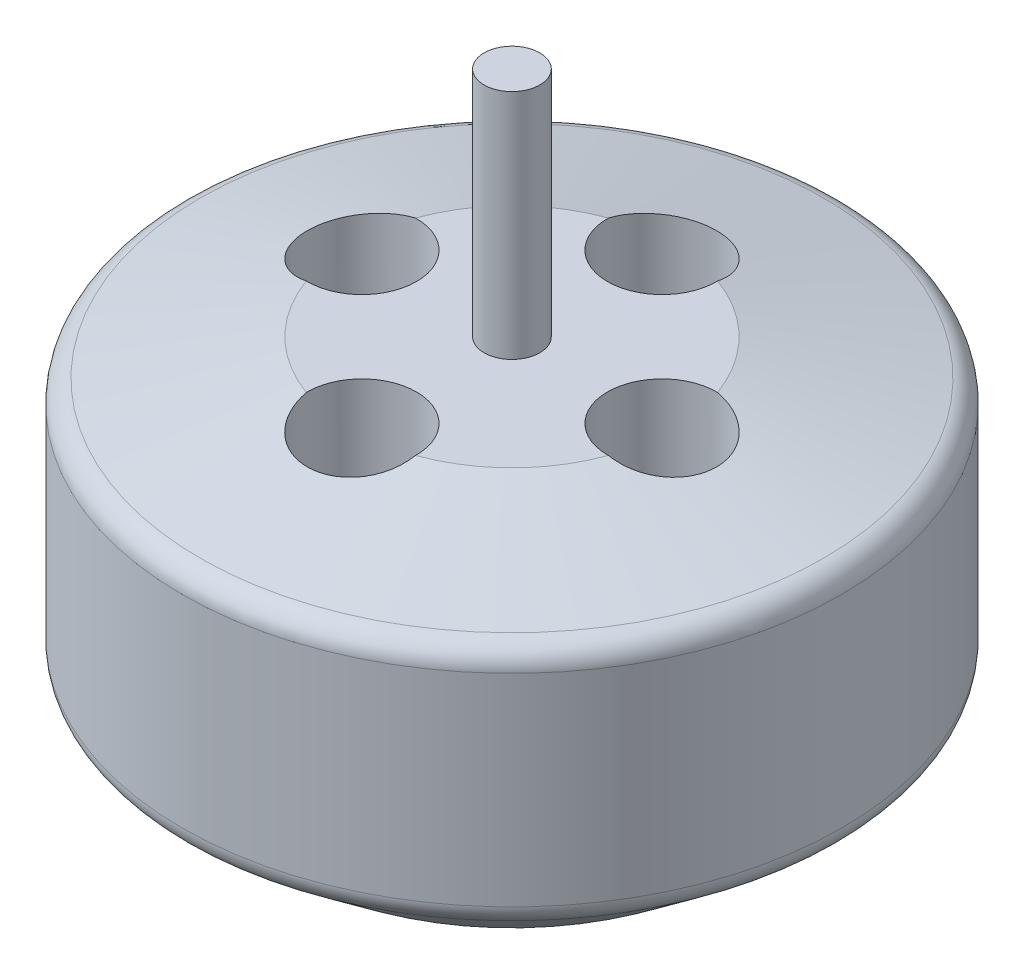
ISO-10303-21;
HEADER;
FILE_DESCRIPTION(('STEP AP214'),'2;1');
FILE_NAME('part.step','',(''),(''),'','','');
FILE_SCHEMA(('AUTOMOTIVE_DESIGN { 1 0 10303 214 1 1 1 1 }'));
ENDSEC;
DATA;
#1=APPLICATION_CONTEXT('core data for automotive mechanical design processes');
#2=APPLICATION_PROTOCOL_DEFINITION('international standard','automotive_design',2000,#1);
#3=PRODUCT_CONTEXT('',#1,'mechanical');
#4=PRODUCT('Part','Part','',(#3));
#5=PRODUCT_RELATED_PRODUCT_CATEGORY('part','',(#4));
#6=PRODUCT_DEFINITION_FORMATION('','',#4);
#7=PRODUCT_DEFINITION_CONTEXT('part definition',#1,'design');
#8=PRODUCT_DEFINITION('design','',#6,#7);
#9=PRODUCT_DEFINITION_SHAPE('','',#8);
#10=(LENGTH_UNIT() NAMED_UNIT(*) SI_UNIT(.MILLI.,.METRE.));
#11=(NAMED_UNIT(*) PLANE_ANGLE_UNIT() SI_UNIT($,.RADIAN.));
#12=(NAMED_UNIT(*) SI_UNIT($,.STERADIAN.) SOLID_ANGLE_UNIT());
#13=UNCERTAINTY_MEASURE_WITH_UNIT(LENGTH_MEASURE(1.E-05),#10,'distance_accuracy_value','');
#14=(GEOMETRIC_REPRESENTATION_CONTEXT(3) GLOBAL_UNCERTAINTY_ASSIGNED_CONTEXT((#13)) GLOBAL_UNIT_ASSIGNED_CONTEXT((#10,
#11,#12)) REPRESENTATION_CONTEXT('',''));
#15=CARTESIAN_POINT('',(0.,0.,0.));
#16=DIRECTION('',(0.,0.,1.));
#17=DIRECTION('',(1.,0.,0.));
#18=AXIS2_PLACEMENT_3D('',#15,#16,#17);
#19=CARTESIAN_POINT('',(1.2,9.23124075479543,0.));
#20=DIRECTION('',(0.,-1.,0.));
#21=DIRECTION('',(1.,0.,0.));
#22=AXIS2_PLACEMENT_3D('',#19,#20,#21);
#23=PLANE('',#22);
#24=CARTESIAN_POINT('',(0.,9.23124075479543,0.));
#25=DIRECTION('',(0.,1.,0.));
#26=DIRECTION('',(-1.,0.,0.));
#27=AXIS2_PLACEMENT_3D('',#24,#25,#26);
#28=CIRCLE('',#27,1.2);
#29=CARTESIAN_POINT('',(-1.2,9.23124075479543,0.));
#30=VERTEX_POINT('',#29);
#31=EDGE_CURVE('E340',#30,#30,#28,.T.);
#32=ORIENTED_EDGE('',*,*,#31,.T.);
#33=EDGE_LOOP('',(#32));
#34=FACE_BOUND('',#33,.T.);
#35=ADVANCED_FACE('F42',(#34),#23,.F.);
#36=CARTESIAN_POINT('',(0.,-15.7687592452046,0.));
#37=DIRECTION('',(0.,1.,0.));
#38=DIRECTION('',(-1.,0.,0.));
#39=AXIS2_PLACEMENT_3D('',#36,#37,#38);
#40=PLANE('',#39);
#41=CARTESIAN_POINT('',(0.,-15.7687592452046,0.));
#42=DIRECTION('',(0.,1.,0.));
#43=DIRECTION('',(-1.,0.,0.));
#44=AXIS2_PLACEMENT_3D('',#41,#42,#43);
#45=CIRCLE('',#44,10.);
#46=CARTESIAN_POINT('',(-10.,-15.7687592452046,0.));
#47=VERTEX_POINT('',#46);
#48=EDGE_CURVE('E106',#47,#47,#45,.T.);
#49=ORIENTED_EDGE('',*,*,#48,.F.);
#50=EDGE_LOOP('',(#49));
#51=FACE_BOUND('',#50,.T.);
#52=ADVANCED_FACE('F153',(#51),#40,.F.);
#53=CARTESIAN_POINT('',(0.,-15.7687592452046,0.));
#54=DIRECTION('',(0.,1.,0.));
#55=DIRECTION('',(-1.,0.,0.));
#56=AXIS2_PLACEMENT_3D('',#53,#54,#55);
#57=CONICAL_SURFACE('',#56,10.,0.91044247390561);
#58=CARTESIAN_POINT('',(0.,-12.79594785704,0.));
#59=DIRECTION('',(0.,-1.,0.));
#60=DIRECTION('',(1.,0.,0.));
#61=AXIS2_PLACEMENT_3D('',#58,#59,#60);
#62=CIRCLE('',#61,13.8276275638373);
#63=CARTESIAN_POINT('',(13.8276275638373,-12.79594785704,0.));
#64=VERTEX_POINT('',#63);
#65=EDGE_CURVE('E50',#64,#64,#62,.T.);
#66=ORIENTED_EDGE('',*,*,#65,.T.);
#67=EDGE_LOOP('',(#66));
#68=FACE_BOUND('',#67,.T.);
#69=ORIENTED_EDGE('',*,*,#48,.T.);
#70=EDGE_LOOP('',(#69));
#71=FACE_BOUND('',#70,.T.);
#72=ADVANCED_FACE('F124',(#68,#71),#57,.T.);
#73=CARTESIAN_POINT('',(0.,9.23124075479543,0.));
#74=DIRECTION('',(0.,1.,0.));
#75=DIRECTION('',(-1.,0.,0.));
#76=AXIS2_PLACEMENT_3D('',#73,#74,#75);
#77=CYLINDRICAL_SURFACE('',#76,14.2142312092208);
#78=CARTESIAN_POINT('',(0.,-12.0061726281659,0.));
#79=DIRECTION('',(0.,-1.,0.));
#80=DIRECTION('',(1.,0.,0.));
#81=AXIS2_PLACEMENT_3D('',#78,#79,#80);
#82=CIRCLE('',#81,14.2142312092208);
#83=CARTESIAN_POINT('',(14.2142312092208,-12.0061726281659,0.));
#84=VERTEX_POINT('',#83);
#85=EDGE_CURVE('E119',#84,#84,#82,.F.);
#86=ORIENTED_EDGE('',*,*,#85,.T.);
#87=EDGE_LOOP('',(#86));
#88=FACE_BOUND('',#87,.T.);
#89=CARTESIAN_POINT('',(0.,-3.28649118160691,0.));
#90=DIRECTION('',(0.,-1.,0.));
#91=DIRECTION('',(1.,0.,0.));
#92=AXIS2_PLACEMENT_3D('',#89,#90,#91);
#93=CIRCLE('',#92,14.2142312092208);
#94=CARTESIAN_POINT('',(14.2142312092208,-3.28649118160691,0.));
#95=VERTEX_POINT('',#94);
#96=EDGE_CURVE('E116',#95,#95,#93,.T.);
#97=ORIENTED_EDGE('',*,*,#96,.T.);
#98=EDGE_LOOP('',(#97));
#99=FACE_BOUND('',#98,.T.);
#100=ADVANCED_FACE('F133',(#88,#99),#77,.T.);
#101=CARTESIAN_POINT('',(0.,-2.4956836070486,0.));
#102=DIRECTION('',(0.,-1.,0.));
#103=DIRECTION('',(1.,0.,0.));
#104=AXIS2_PLACEMENT_3D('',#101,#102,#103);
#105=CONICAL_SURFACE('',#104,14.2142312092208,1.33822123398075);
#106=CARTESIAN_POINT('',(0.,-2.31341507747465,0.));
#107=DIRECTION('',(0.,1.,0.));
#108=DIRECTION('',(-1.,0.,0.));
#109=AXIS2_PLACEMENT_3D('',#106,#107,#108);
#110=CIRCLE('',#109,13.4447152554514);
#111=CARTESIAN_POINT('',(-13.4447152554514,-2.31341507747465,0.));
#112=VERTEX_POINT('',#111);
#113=EDGE_CURVE('E11',#112,#112,#110,.T.);
#114=ORIENTED_EDGE('',*,*,#113,.T.);
#115=EDGE_LOOP('',(#114));
#116=FACE_BOUND('',#115,.T.);
#117=CARTESIAN_POINT('',(0.,-0.768759245204573,0.));
#118=DIRECTION('',(0.,1.,0.));
#119=DIRECTION('',(-1.,0.,0.));
#120=AXIS2_PLACEMENT_3D('',#117,#118,#119);
#121=CIRCLE('',#120,6.92336289257609);
#122=CARTESIAN_POINT('',(6.51163456727097,-0.768759245204573,-2.35192878391788));
#123=VERTEX_POINT('',#122);
#124=CARTESIAN_POINT('',(2.35192878391786,-0.768759245204573,-6.51163456727098));
#125=VERTEX_POINT('',#124);
#126=EDGE_CURVE('E100',#123,#125,#121,.T.);
#127=ORIENTED_EDGE('',*,*,#126,.F.);
#128=CARTESIAN_POINT('',(6.51073113622683,-0.768559245204572,-2.35194444719157));
#129=CARTESIAN_POINT('',(6.57745570014125,-0.783332000693089,-2.35079951486765));
#130=CARTESIAN_POINT('',(6.64414594371814,-0.797896410721011,-2.34681484952383));
#131=CARTESIAN_POINT('',(6.77704791080668,-0.826556435951298,-2.33317538062952));
#132=CARTESIAN_POINT('',(6.84325961566661,-0.840652032957309,-2.32352035726236));
#133=CARTESIAN_POINT('',(7.04043922069012,-0.882131542247833,-2.28608604984196));
#134=CARTESIAN_POINT('',(7.17006979071747,-0.908734201870526,-2.24983548351801));
#135=CARTESIAN_POINT('',(7.42175242029025,-0.959348046210853,-2.15552952535404));
#136=CARTESIAN_POINT('',(7.54379764298048,-0.983356907059352,-2.09745478572058));
#137=CARTESIAN_POINT('',(7.77652527636077,-1.02836673670914,-1.96099362154545));
#138=CARTESIAN_POINT('',(7.88721277280557,-1.04936905345793,-1.88261634396145));
#139=CARTESIAN_POINT('',(8.09242117753741,-1.08777141214169,-1.70885134274292));
#140=CARTESIAN_POINT('',(8.1871395859977,-1.10521612446328,-1.61370670887939));
#141=CARTESIAN_POINT('',(8.35927102691237,-1.13658432289664,-1.40833474847909));
#142=CARTESIAN_POINT('',(8.43668214306363,-1.15050741910939,-1.29810575394336));
#143=CARTESIAN_POINT('',(8.57056019382037,-1.17440477346539,-1.06773986315712));
#144=CARTESIAN_POINT('',(8.62736161665646,-1.18444229161354,-0.947803860994472));
#145=CARTESIAN_POINT('',(8.72006108790814,-1.20074842149062,-0.699878812982907));
#146=CARTESIAN_POINT('',(8.75596226284117,-1.20701759693939,-0.571890974802866));
#147=CARTESIAN_POINT('',(8.80543268258466,-1.21564116706093,-0.313146809127175));
#148=CARTESIAN_POINT('',(8.81926575402206,-1.21804181398905,-0.182442409671675));
#149=CARTESIAN_POINT('',(8.82499935520962,-1.2190378623536,0.079461803351905));
#150=CARTESIAN_POINT('',(8.81690022350594,-1.21763332252701,0.210661609241658));
#151=CARTESIAN_POINT('',(8.77911478827728,-1.21105602525459,0.469162967863097));
#152=CARTESIAN_POINT('',(8.74953328702659,-1.20590156168721,0.596480330548431));
#153=CARTESIAN_POINT('',(8.66981159477426,-1.19192106622568,0.844290066132482));
#154=CARTESIAN_POINT('',(8.61967132580615,-1.18309502040753,0.964782413146237));
#155=CARTESIAN_POINT('',(8.50016504794809,-1.16186678381963,1.19596549099957));
#156=CARTESIAN_POINT('',(8.43073807407807,-1.1494532479475,1.30662364740527));
#157=CARTESIAN_POINT('',(8.27482249070631,-1.12124473587403,1.51467821612671));
#158=CARTESIAN_POINT('',(8.18833436824035,-1.10544985619708,1.61207500687367));
#159=CARTESIAN_POINT('',(7.99987320250692,-1.07053055319193,1.7919666605331));
#160=CARTESIAN_POINT('',(7.89774934702098,-1.05137340314538,1.87429709211899));
#161=CARTESIAN_POINT('',(7.68163142266157,-1.01012250688596,2.02070362380707));
#162=CARTESIAN_POINT('',(7.5676319238232,-0.988027416054875,2.08477132307443));
#163=CARTESIAN_POINT('',(7.32912445269111,-0.940863912960976,2.19393902311257));
#164=CARTESIAN_POINT('',(7.20447371298487,-0.915752318520397,2.23870731925564));
#165=CARTESIAN_POINT('',(6.95000958945558,-0.863284526982055,2.30662848129599));
#166=CARTESIAN_POINT('',(6.82020520532017,-0.835932161105562,2.32981743718907));
#167=CARTESIAN_POINT('',(6.65995368452852,-0.801282153219907,2.34483315231515));
#168=CARTESIAN_POINT('',(6.63011257555051,-0.794792532139539,2.34705354010905));
#169=CARTESIAN_POINT('',(6.57042820344879,-0.781735662258181,2.35035172304495));
#170=CARTESIAN_POINT('',(6.54058500212942,-0.775168535190601,2.35143111743687));
#171=CARTESIAN_POINT('',(6.51073113622685,-0.768559245204573,2.35194444719153));
#172=B_SPLINE_CURVE_WITH_KNOTS('',3,(#128,#129,#130,#131,#132,#133,#134,#135,#136,#137,#138,
#139,#140,#141,#142,#143,#144,#145,#146,#147,#148,#149,#150,#151,#152,#153,#154,#155,#156,#157,
#158,#159,#160,#161,#162,#163,#164,#165,#166,#167,#168,#169,#170,#171),.UNSPECIFIED.,.F.,.F.,(4,
2,2,2,2,2,2,2,2,2,2,2,2,2,2,2,2,2,2,2,2,4),(0.,0.204927794866284,0.409863534472579,
0.819376483817849,1.22925333860041,1.63894585065763,2.0431254136225,2.44734970613807,
2.84468432539909,3.24195949115259,3.63444860507638,4.02693166056075,4.41751273152939,
4.80809528373992,5.19992679206895,5.59174711660468,5.98761729182822,6.38366927407366,
6.78628044099226,7.18821705127296,7.28006361052621,7.37178126354771),.UNSPECIFIED.);
#173=CARTESIAN_POINT('',(6.51163456727099,-0.768759245204573,2.35192878391783));
#174=VERTEX_POINT('',#173);
#175=EDGE_CURVE('E320',#123,#174,#172,.T.);
#176=ORIENTED_EDGE('',*,*,#175,.T.);
#177=CARTESIAN_POINT('',(2.35192878391786,-0.768759245204573,6.51163456727098));
#178=VERTEX_POINT('',#177);
#179=EDGE_CURVE('E102',#178,#174,#121,.T.);
#180=ORIENTED_EDGE('',*,*,#179,.F.);
#181=CARTESIAN_POINT('',(2.35194444719155,-0.768559245204572,6.51073113622684));
#182=CARTESIAN_POINT('',(2.35079951486763,-0.783332000693089,6.57745570014126));
#183=CARTESIAN_POINT('',(2.3468148495238,-0.797896410721011,6.64414594371815));
#184=CARTESIAN_POINT('',(2.3331753806295,-0.826556435951298,6.77704791080669));
#185=CARTESIAN_POINT('',(2.32352035726234,-0.840652032957309,6.84325961566662));
#186=CARTESIAN_POINT('',(2.28608604984194,-0.882131542247833,7.04043922069013));
#187=CARTESIAN_POINT('',(2.24983548351799,-0.908734201870526,7.17006979071748));
#188=CARTESIAN_POINT('',(2.15552952535401,-0.959348046210853,7.42175242029026));
#189=CARTESIAN_POINT('',(2.09745478572055,-0.983356907059353,7.54379764298049));
#190=CARTESIAN_POINT('',(1.96099362154542,-1.02836673670914,7.77652527636077));
#191=CARTESIAN_POINT('',(1.88261634396142,-1.04936905345793,7.88721277280558));
#192=CARTESIAN_POINT('',(1.70885134274288,-1.08777141214169,8.09242117753742));
#193=CARTESIAN_POINT('',(1.61370670887936,-1.10521612446328,8.18713958599771));
#194=CARTESIAN_POINT('',(1.40833474847906,-1.13658432289665,8.35927102691238));
#195=CARTESIAN_POINT('',(1.29810575394333,-1.15050741910939,8.43668214306363));
#196=CARTESIAN_POINT('',(1.06773986315709,-1.17440477346539,8.57056019382037));
#197=CARTESIAN_POINT('',(0.94780386099444,-1.18444229161354,8.62736161665646));
#198=CARTESIAN_POINT('',(0.699878812982874,-1.20074842149062,8.72006108790814));
#199=CARTESIAN_POINT('',(0.571890974802832,-1.20701759693939,8.75596226284118));
#200=CARTESIAN_POINT('',(0.313146809127141,-1.21564116706093,8.80543268258466));
#201=CARTESIAN_POINT('',(0.182442409671641,-1.21804181398905,8.81926575402207));
#202=CARTESIAN_POINT('',(-0.0794618033519384,-1.2190378623536,8.82499935520962));
#203=CARTESIAN_POINT('',(-0.210661609241692,-1.21763332252701,8.81690022350594));
#204=CARTESIAN_POINT('',(-0.469162967863131,-1.21105602525459,8.77911478827728));
#205=CARTESIAN_POINT('',(-0.596480330548465,-1.20590156168721,8.74953328702659));
#206=CARTESIAN_POINT('',(-0.844290066132515,-1.19192106622568,8.66981159477425));
#207=CARTESIAN_POINT('',(-0.96478241314627,-1.18309502040753,8.61967132580614));
#208=CARTESIAN_POINT('',(-1.1959654909996,-1.16186678381963,8.50016504794808));
#209=CARTESIAN_POINT('',(-1.3066236474053,-1.1494532479475,8.43073807407806));
#210=CARTESIAN_POINT('',(-1.51467821612674,-1.12124473587403,8.2748224907063));
#211=CARTESIAN_POINT('',(-1.6120750068737,-1.10544985619708,8.18833436824034));
#212=CARTESIAN_POINT('',(-1.79196666053313,-1.07053055319193,7.99987320250691));
#213=CARTESIAN_POINT('',(-1.87429709211902,-1.05137340314538,7.89774934702097));
#214=CARTESIAN_POINT('',(-2.02070362380709,-1.01012250688596,7.68163142266156));
#215=CARTESIAN_POINT('',(-2.08477132307446,-0.988027416054875,7.5676319238232));
#216=CARTESIAN_POINT('',(-2.1939390231126,-0.940863912960975,7.32912445269111));
#217=CARTESIAN_POINT('',(-2.23870731925567,-0.915752318520396,7.20447371298486));
#218=CARTESIAN_POINT('',(-2.30662848129602,-0.863284526982055,6.95000958945557));
#219=CARTESIAN_POINT('',(-2.3298174371891,-0.835932161105563,6.82020520532016));
#220=CARTESIAN_POINT('',(-2.34483315231518,-0.801282153219907,6.65995368452851));
#221=CARTESIAN_POINT('',(-2.34705354010907,-0.794792532139538,6.6301125755505));
#222=CARTESIAN_POINT('',(-2.35035172304497,-0.781735662258181,6.57042820344878));
#223=CARTESIAN_POINT('',(-2.3514311174369,-0.775168535190601,6.54058500212942));
#224=CARTESIAN_POINT('',(-2.35194444719155,-0.768559245204573,6.51073113622684));
#225=B_SPLINE_CURVE_WITH_KNOTS('',3,(#181,#182,#183,#184,#185,#186,#187,#188,#189,#190,#191,
#192,#193,#194,#195,#196,#197,#198,#199,#200,#201,#202,#203,#204,#205,#206,#207,#208,#209,#210,
#211,#212,#213,#214,#215,#216,#217,#218,#219,#220,#221,#222,#223,#224),.UNSPECIFIED.,.F.,.F.,(4,
2,2,2,2,2,2,2,2,2,2,2,2,2,2,2,2,2,2,2,2,4),(0.,0.204927794866284,0.409863534472579,
0.819376483817851,1.22925333860041,1.63894585065763,2.0431254136225,2.44734970613807,
2.84468432539909,3.24195949115259,3.63444860507638,4.02693166056075,4.4175127315294,
4.80809528373992,5.19992679206896,5.59174711660468,5.98761729182822,6.38366927407366,
6.78628044099226,7.18821705127296,7.28006361052621,7.37178126354771),.UNSPECIFIED.);
#226=CARTESIAN_POINT('',(-2.35192878391786,-0.768759245204573,6.51163456727098));
#227=VERTEX_POINT('',#226);
#228=EDGE_CURVE('E335',#178,#227,#225,.T.);
#229=ORIENTED_EDGE('',*,*,#228,.T.);
#230=CARTESIAN_POINT('',(-6.51163456727096,-0.768759245204573,2.35192878391792));
#231=VERTEX_POINT('',#230);
#232=EDGE_CURVE('E94',#231,#227,#121,.T.);
#233=ORIENTED_EDGE('',*,*,#232,.F.);
#234=CARTESIAN_POINT('',(-6.51073113622682,-0.768559245204573,2.35194444719161));
#235=CARTESIAN_POINT('',(-6.57745570014124,-0.78333200069309,2.3507995148677));
#236=CARTESIAN_POINT('',(-6.64414594371812,-0.797896410721011,2.34681484952387));
#237=CARTESIAN_POINT('',(-6.77704791080667,-0.826556435951298,2.33317538062957));
#238=CARTESIAN_POINT('',(-6.8432596156666,-0.840652032957309,2.32352035726241));
#239=CARTESIAN_POINT('',(-7.04043922069011,-0.882131542247833,2.28608604984201));
#240=CARTESIAN_POINT('',(-7.17006979071745,-0.908734201870526,2.24983548351806));
#241=CARTESIAN_POINT('',(-7.42175242029024,-0.959348046210854,2.15552952535409));
#242=CARTESIAN_POINT('',(-7.54379764298046,-0.983356907059353,2.09745478572063));
#243=CARTESIAN_POINT('',(-7.77652527636075,-1.02836673670914,1.96099362154551));
#244=CARTESIAN_POINT('',(-7.88721277280556,-1.04936905345793,1.88261634396151));
#245=CARTESIAN_POINT('',(-8.0924211775374,-1.08777141214169,1.70885134274297));
#246=CARTESIAN_POINT('',(-8.18713958599769,-1.10521612446328,1.61370670887944));
#247=CARTESIAN_POINT('',(-8.35927102691237,-1.13658432289665,1.40833474847915));
#248=CARTESIAN_POINT('',(-8.43668214306362,-1.15050741910939,1.29810575394342));
#249=CARTESIAN_POINT('',(-8.57056019382036,-1.17440477346539,1.06773986315718));
#250=CARTESIAN_POINT('',(-8.62736161665645,-1.18444229161354,0.94780386099453));
#251=CARTESIAN_POINT('',(-8.72006108790814,-1.20074842149062,0.699878812982966));
#252=CARTESIAN_POINT('',(-8.75596226284117,-1.20701759693939,0.571890974802926));
#253=CARTESIAN_POINT('',(-8.80543268258466,-1.21564116706093,0.313146809127235));
#254=CARTESIAN_POINT('',(-8.81926575402206,-1.21804181398905,0.182442409671735));
#255=CARTESIAN_POINT('',(-8.82499935520962,-1.2190378623536,-0.0794618033518449));
#256=CARTESIAN_POINT('',(-8.81690022350594,-1.21763332252701,-0.210661609241598));
#257=CARTESIAN_POINT('',(-8.77911478827728,-1.21105602525459,-0.469162967863038));
#258=CARTESIAN_POINT('',(-8.74953328702659,-1.20590156168721,-0.596480330548372));
#259=CARTESIAN_POINT('',(-8.66981159477426,-1.19192106622568,-0.844290066132423));
#260=CARTESIAN_POINT('',(-8.61967132580615,-1.18309502040753,-0.964782413146178));
#261=CARTESIAN_POINT('',(-8.50016504794809,-1.16186678381963,-1.19596549099951));
#262=CARTESIAN_POINT('',(-8.43073807407808,-1.1494532479475,-1.30662364740521));
#263=CARTESIAN_POINT('',(-8.27482249070632,-1.12124473587403,-1.51467821612665));
#264=CARTESIAN_POINT('',(-8.18833436824036,-1.10544985619708,-1.61207500687362));
#265=CARTESIAN_POINT('',(-7.99987320250693,-1.07053055319193,-1.79196666053305));
#266=CARTESIAN_POINT('',(-7.89774934702099,-1.05137340314538,-1.87429709211894));
#267=CARTESIAN_POINT('',(-7.68163142266158,-1.01012250688596,-2.02070362380701));
#268=CARTESIAN_POINT('',(-7.56763192382322,-0.988027416054875,-2.08477132307438));
#269=CARTESIAN_POINT('',(-7.32912445269113,-0.940863912960975,-2.19393902311252));
#270=CARTESIAN_POINT('',(-7.20447371298488,-0.915752318520397,-2.23870731925559));
#271=CARTESIAN_POINT('',(-6.95000958945559,-0.863284526982055,-2.30662848129594));
#272=CARTESIAN_POINT('',(-6.82020520532018,-0.835932161105561,-2.32981743718902));
#273=CARTESIAN_POINT('',(-6.65995368452854,-0.801282153219907,-2.3448331523151));
#274=CARTESIAN_POINT('',(-6.63011257555052,-0.794792532139538,-2.347053540109));
#275=CARTESIAN_POINT('',(-6.57042820344881,-0.781735662258181,-2.3503517230449));
#276=CARTESIAN_POINT('',(-6.54058500212944,-0.775168535190601,-2.35143111743683));
#277=CARTESIAN_POINT('',(-6.51073113622687,-0.768559245204573,-2.35194444719148));
#278=B_SPLINE_CURVE_WITH_KNOTS('',3,(#234,#235,#236,#237,#238,#239,#240,#241,#242,#243,#244,
#245,#246,#247,#248,#249,#250,#251,#252,#253,#254,#255,#256,#257,#258,#259,#260,#261,#262,#263,
#264,#265,#266,#267,#268,#269,#270,#271,#272,#273,#274,#275,#276,#277),.UNSPECIFIED.,.F.,.F.,(4,
2,2,2,2,2,2,2,2,2,2,2,2,2,2,2,2,2,2,2,2,4),(0.,0.204927794866283,0.409863534472579,
0.819376483817849,1.22925333860041,1.63894585065763,2.0431254136225,2.44734970613807,
2.84468432539909,3.24195949115259,3.63444860507638,4.02693166056075,4.4175127315294,
4.80809528373992,5.19992679206895,5.59174711660468,5.98761729182822,6.38366927407366,
6.78628044099226,7.18821705127296,7.28006361052621,7.37178126354771),.UNSPECIFIED.);
#279=CARTESIAN_POINT('',(-6.511634567271,-0.768759245204573,-2.35192878391779));
#280=VERTEX_POINT('',#279);
#281=EDGE_CURVE('E56',#231,#280,#278,.T.);
#282=ORIENTED_EDGE('',*,*,#281,.T.);
#283=CARTESIAN_POINT('',(-2.35192878391786,-0.768759245204573,-6.51163456727098));
#284=VERTEX_POINT('',#283);
#285=EDGE_CURVE('E92',#284,#280,#121,.T.);
#286=ORIENTED_EDGE('',*,*,#285,.F.);
#287=CARTESIAN_POINT('',(-2.35194444719155,-0.768559245204572,-6.51073113622684));
#288=CARTESIAN_POINT('',(-2.35079951486763,-0.783332000693089,-6.57745570014126));
#289=CARTESIAN_POINT('',(-2.3468148495238,-0.797896410721011,-6.64414594371815));
#290=CARTESIAN_POINT('',(-2.3331753806295,-0.826556435951298,-6.77704791080669));
#291=CARTESIAN_POINT('',(-2.32352035726234,-0.840652032957309,-6.84325961566662));
#292=CARTESIAN_POINT('',(-2.28608604984194,-0.882131542247833,-7.04043922069013));
#293=CARTESIAN_POINT('',(-2.24983548351799,-0.908734201870526,-7.17006979071748));
#294=CARTESIAN_POINT('',(-2.15552952535401,-0.959348046210853,-7.42175242029026));
#295=CARTESIAN_POINT('',(-2.09745478572055,-0.983356907059352,-7.54379764298049));
#296=CARTESIAN_POINT('',(-1.96099362154542,-1.02836673670914,-7.77652527636077));
#297=CARTESIAN_POINT('',(-1.88261634396142,-1.04936905345793,-7.88721277280558));
#298=CARTESIAN_POINT('',(-1.70885134274288,-1.08777141214169,-8.09242117753742));
#299=CARTESIAN_POINT('',(-1.61370670887936,-1.10521612446328,-8.18713958599771));
#300=CARTESIAN_POINT('',(-1.40833474847906,-1.13658432289665,-8.35927102691238));
#301=CARTESIAN_POINT('',(-1.29810575394333,-1.15050741910939,-8.43668214306363));
#302=CARTESIAN_POINT('',(-1.06773986315709,-1.17440477346539,-8.57056019382037));
#303=CARTESIAN_POINT('',(-0.947803860994439,-1.18444229161354,-8.62736161665646));
#304=CARTESIAN_POINT('',(-0.699878812982873,-1.20074842149062,-8.72006108790814));
#305=CARTESIAN_POINT('',(-0.571890974802832,-1.20701759693939,-8.75596226284118));
#306=CARTESIAN_POINT('',(-0.313146809127141,-1.21564116706093,-8.80543268258466));
#307=CARTESIAN_POINT('',(-0.182442409671641,-1.21804181398905,-8.81926575402207));
#308=CARTESIAN_POINT('',(0.0794618033519385,-1.2190378623536,-8.82499935520962));
#309=CARTESIAN_POINT('',(0.210661609241692,-1.21763332252701,-8.81690022350594));
#310=CARTESIAN_POINT('',(0.469162967863131,-1.21105602525459,-8.77911478827728));
#311=CARTESIAN_POINT('',(0.596480330548465,-1.20590156168721,-8.74953328702659));
#312=CARTESIAN_POINT('',(0.844290066132515,-1.19192106622568,-8.66981159477425));
#313=CARTESIAN_POINT('',(0.96478241314627,-1.18309502040753,-8.61967132580614));
#314=CARTESIAN_POINT('',(1.1959654909996,-1.16186678381963,-8.50016504794808));
#315=CARTESIAN_POINT('',(1.3066236474053,-1.1494532479475,-8.43073807407806));
#316=CARTESIAN_POINT('',(1.51467821612674,-1.12124473587403,-8.2748224907063));
#317=CARTESIAN_POINT('',(1.6120750068737,-1.10544985619708,-8.18833436824034));
#318=CARTESIAN_POINT('',(1.79196666053313,-1.07053055319193,-7.99987320250691));
#319=CARTESIAN_POINT('',(1.87429709211902,-1.05137340314538,-7.89774934702097));
#320=CARTESIAN_POINT('',(2.02070362380709,-1.01012250688596,-7.68163142266156));
#321=CARTESIAN_POINT('',(2.08477132307446,-0.988027416054875,-7.5676319238232));
#322=CARTESIAN_POINT('',(2.1939390231126,-0.940863912960975,-7.3291244526911));
#323=CARTESIAN_POINT('',(2.23870731925567,-0.915752318520396,-7.20447371298486));
#324=CARTESIAN_POINT('',(2.30662848129602,-0.863284526982054,-6.95000958945557));
#325=CARTESIAN_POINT('',(2.3298174371891,-0.835932161105562,-6.82020520532016));
#326=CARTESIAN_POINT('',(2.34483315231518,-0.801282153219906,-6.65995368452851));
#327=CARTESIAN_POINT('',(2.34705354010907,-0.794792532139538,-6.6301125755505));
#328=CARTESIAN_POINT('',(2.35035172304497,-0.781735662258181,-6.57042820344878));
#329=CARTESIAN_POINT('',(2.3514311174369,-0.775168535190601,-6.54058500212942));
#330=CARTESIAN_POINT('',(2.35194444719155,-0.768559245204573,-6.51073113622684));
#331=B_SPLINE_CURVE_WITH_KNOTS('',3,(#287,#288,#289,#290,#291,#292,#293,#294,#295,#296,#297,
#298,#299,#300,#301,#302,#303,#304,#305,#306,#307,#308,#309,#310,#311,#312,#313,#314,#315,#316,
#317,#318,#319,#320,#321,#322,#323,#324,#325,#326,#327,#328,#329,#330),.UNSPECIFIED.,.F.,.F.,(4,
2,2,2,2,2,2,2,2,2,2,2,2,2,2,2,2,2,2,2,2,4),(0.,0.204927794866284,0.409863534472579,
0.819376483817851,1.22925333860041,1.63894585065763,2.0431254136225,2.44734970613807,
2.84468432539909,3.24195949115259,3.63444860507638,4.02693166056075,4.4175127315294,
4.80809528373992,5.19992679206895,5.59174711660468,5.98761729182822,6.38366927407366,
6.78628044099225,7.18821705127296,7.28006361052621,7.37178126354771),.UNSPECIFIED.);
#332=EDGE_CURVE('E63',#284,#125,#331,.T.);
#333=ORIENTED_EDGE('',*,*,#332,.T.);
#334=EDGE_LOOP('',(#127,#176,#180,#229,#233,#282,#286,#333));
#335=FACE_BOUND('',#334,.T.);
#336=ADVANCED_FACE('F91',(#116,#335),#105,.T.);
#337=CARTESIAN_POINT('',(1.2,-0.768759245204573,0.));
#338=DIRECTION('',(0.,-1.,0.));
#339=DIRECTION('',(1.,0.,0.));
#340=AXIS2_PLACEMENT_3D('',#337,#338,#339);
#341=PLANE('',#340);
#342=CARTESIAN_POINT('',(0.,-0.768759245204573,0.));
#343=DIRECTION('',(0.,1.,0.));
#344=DIRECTION('',(-1.,0.,0.));
#345=AXIS2_PLACEMENT_3D('',#342,#343,#344);
#346=CIRCLE('',#345,1.2);
#347=CARTESIAN_POINT('',(-1.2,-0.768759245204573,0.));
#348=VERTEX_POINT('',#347);
#349=EDGE_CURVE('E103',#348,#348,#346,.T.);
#350=ORIENTED_EDGE('',*,*,#349,.F.);
#351=EDGE_LOOP('',(#350));
#352=FACE_BOUND('',#351,.T.);
#353=ORIENTED_EDGE('',*,*,#179,.T.);
#354=CARTESIAN_POINT('',(6.47040605185298,-0.768759245204573,0.));
#355=DIRECTION('',(0.,-1.,0.));
#356=DIRECTION('',(1.,0.,0.));
#357=AXIS2_PLACEMENT_3D('',#354,#355,#356);
#358=CIRCLE('',#357,2.35229011712095);
#359=EDGE_CURVE('E113',#174,#123,#358,.T.);
#360=ORIENTED_EDGE('',*,*,#359,.T.);
#361=ORIENTED_EDGE('',*,*,#126,.T.);
#362=CARTESIAN_POINT('',(0.,-0.768759245204573,-6.47040605185298));
#363=DIRECTION('',(0.,-1.,0.));
#364=DIRECTION('',(1.,0.,0.));
#365=AXIS2_PLACEMENT_3D('',#362,#363,#364);
#366=CIRCLE('',#365,2.35229011712095);
#367=EDGE_CURVE('E85',#125,#284,#366,.T.);
#368=ORIENTED_EDGE('',*,*,#367,.T.);
#369=ORIENTED_EDGE('',*,*,#285,.T.);
#370=CARTESIAN_POINT('',(-6.47040605185298,-0.768759245204573,0.));
#371=DIRECTION('',(0.,-1.,0.));
#372=DIRECTION('',(1.,0.,0.));
#373=AXIS2_PLACEMENT_3D('',#370,#371,#372);
#374=CIRCLE('',#373,2.35229011712095);
#375=EDGE_CURVE('E80',#280,#231,#374,.T.);
#376=ORIENTED_EDGE('',*,*,#375,.T.);
#377=ORIENTED_EDGE('',*,*,#232,.T.);
#378=CARTESIAN_POINT('',(0.,-0.768759245204573,6.47040605185298));
#379=DIRECTION('',(0.,-1.,0.));
#380=DIRECTION('',(1.,0.,0.));
#381=AXIS2_PLACEMENT_3D('',#378,#379,#380);
#382=CIRCLE('',#381,2.35229011712095);
#383=EDGE_CURVE('E86',#227,#178,#382,.T.);
#384=ORIENTED_EDGE('',*,*,#383,.T.);
#385=EDGE_LOOP('',(#353,#360,#361,#368,#369,#376,#377,#384));
#386=FACE_BOUND('',#385,.T.);
#387=ADVANCED_FACE('F98',(#352,#386),#341,.F.);
#388=CARTESIAN_POINT('',(0.,9.23124075479543,0.));
#389=DIRECTION('',(0.,1.,0.));
#390=DIRECTION('',(-1.,0.,0.));
#391=AXIS2_PLACEMENT_3D('',#388,#389,#390);
#392=CYLINDRICAL_SURFACE('',#391,1.2);
#393=ORIENTED_EDGE('',*,*,#31,.F.);
#394=EDGE_LOOP('',(#393));
#395=FACE_BOUND('',#394,.T.);
#396=ORIENTED_EDGE('',*,*,#349,.T.);
#397=EDGE_LOOP('',(#396));
#398=FACE_BOUND('',#397,.T.);
#399=ADVANCED_FACE('F148',(#395,#398),#392,.T.);
#400=CARTESIAN_POINT('',(0.,-5.38437962260229,6.47040605185298));
#401=DIRECTION('',(0.,1.,0.));
#402=DIRECTION('',(-1.,0.,0.));
#403=AXIS2_PLACEMENT_3D('',#400,#401,#402);
#404=CYLINDRICAL_SURFACE('',#403,2.35229011712095);
#405=CARTESIAN_POINT('',(0.,-5.38437962260229,6.47040605185298));
#406=DIRECTION('',(0.,1.,0.));
#407=DIRECTION('',(-1.,0.,0.));
#408=AXIS2_PLACEMENT_3D('',#405,#406,#407);
#409=CIRCLE('',#408,2.35229011712095);
#410=CARTESIAN_POINT('',(-2.35229011712095,-5.38437962260229,6.47040605185298));
#411=VERTEX_POINT('',#410);
#412=EDGE_CURVE('E332',#411,#411,#409,.T.);
#413=ORIENTED_EDGE('',*,*,#412,.F.);
#414=EDGE_LOOP('',(#413));
#415=FACE_BOUND('',#414,.T.);
#416=ORIENTED_EDGE('',*,*,#383,.F.);
#417=ORIENTED_EDGE('',*,*,#228,.F.);
#418=EDGE_LOOP('',(#416,#417));
#419=FACE_BOUND('',#418,.T.);
#420=ADVANCED_FACE('F194',(#415,#419),#404,.F.);
#421=CARTESIAN_POINT('',(0.,-5.38437962260229,6.47040605185298));
#422=DIRECTION('',(0.,1.,0.));
#423=DIRECTION('',(-1.,0.,0.));
#424=AXIS2_PLACEMENT_3D('',#421,#422,#423);
#425=PLANE('',#424);
#426=ORIENTED_EDGE('',*,*,#412,.T.);
#427=EDGE_LOOP('',(#426));
#428=FACE_BOUND('',#427,.T.);
#429=ADVANCED_FACE('F199',(#428),#425,.T.);
#430=CARTESIAN_POINT('',(-6.47040605185298,-5.38437962260229,0.));
#431=DIRECTION('',(0.,1.,0.));
#432=DIRECTION('',(-1.,0.,0.));
#433=AXIS2_PLACEMENT_3D('',#430,#431,#432);
#434=CYLINDRICAL_SURFACE('',#433,2.35229011712095);
#435=CARTESIAN_POINT('',(-6.47040605185298,-5.38437962260229,0.));
#436=DIRECTION('',(0.,1.,0.));
#437=DIRECTION('',(0.,0.,-1.));
#438=AXIS2_PLACEMENT_3D('',#435,#436,#437);
#439=CIRCLE('',#438,2.35229011712095);
#440=CARTESIAN_POINT('',(-6.47040605185301,-5.38437962260229,-2.35229011712088));
#441=VERTEX_POINT('',#440);
#442=EDGE_CURVE('E352',#441,#441,#439,.T.);
#443=ORIENTED_EDGE('',*,*,#442,.F.);
#444=EDGE_LOOP('',(#443));
#445=FACE_BOUND('',#444,.T.);
#446=ORIENTED_EDGE('',*,*,#375,.F.);
#447=ORIENTED_EDGE('',*,*,#281,.F.);
#448=EDGE_LOOP('',(#446,#447));
#449=FACE_BOUND('',#448,.T.);
#450=ADVANCED_FACE('F81',(#445,#449),#434,.F.);
#451=CARTESIAN_POINT('',(-6.47040605185298,-5.38437962260229,0.));
#452=DIRECTION('',(0.,1.,0.));
#453=DIRECTION('',(0.,0.,-1.));
#454=AXIS2_PLACEMENT_3D('',#451,#452,#453);
#455=PLANE('',#454);
#456=ORIENTED_EDGE('',*,*,#442,.T.);
#457=EDGE_LOOP('',(#456));
#458=FACE_BOUND('',#457,.T.);
#459=ADVANCED_FACE('F213',(#458),#455,.T.);
#460=CARTESIAN_POINT('',(0.,-5.38437962260229,-6.47040605185298));
#461=DIRECTION('',(0.,1.,0.));
#462=DIRECTION('',(-1.,0.,0.));
#463=AXIS2_PLACEMENT_3D('',#460,#461,#462);
#464=CYLINDRICAL_SURFACE('',#463,2.35229011712095);
#465=CARTESIAN_POINT('',(0.,-5.38437962260229,-6.47040605185298));
#466=DIRECTION('',(0.,1.,0.));
#467=DIRECTION('',(1.,0.,0.));
#468=AXIS2_PLACEMENT_3D('',#465,#466,#467);
#469=CIRCLE('',#468,2.35229011712095);
#470=CARTESIAN_POINT('',(2.35229011712095,-5.38437962260229,-6.47040605185298));
#471=VERTEX_POINT('',#470);
#472=EDGE_CURVE('E355',#471,#471,#469,.T.);
#473=ORIENTED_EDGE('',*,*,#472,.F.);
#474=EDGE_LOOP('',(#473));
#475=FACE_BOUND('',#474,.T.);
#476=ORIENTED_EDGE('',*,*,#367,.F.);
#477=ORIENTED_EDGE('',*,*,#332,.F.);
#478=EDGE_LOOP('',(#476,#477));
#479=FACE_BOUND('',#478,.T.);
#480=ADVANCED_FACE('F222',(#475,#479),#464,.F.);
#481=CARTESIAN_POINT('',(0.,-5.38437962260229,-6.47040605185298));
#482=DIRECTION('',(0.,1.,0.));
#483=DIRECTION('',(1.,0.,0.));
#484=AXIS2_PLACEMENT_3D('',#481,#482,#483);
#485=PLANE('',#484);
#486=ORIENTED_EDGE('',*,*,#472,.T.);
#487=EDGE_LOOP('',(#486));
#488=FACE_BOUND('',#487,.T.);
#489=ADVANCED_FACE('F184',(#488),#485,.T.);
#490=CARTESIAN_POINT('',(6.47040605185298,-5.38437962260229,0.));
#491=DIRECTION('',(0.,1.,0.));
#492=DIRECTION('',(-1.,0.,0.));
#493=AXIS2_PLACEMENT_3D('',#490,#491,#492);
#494=CYLINDRICAL_SURFACE('',#493,2.35229011712095);
#495=CARTESIAN_POINT('',(6.47040605185298,-5.38437962260229,0.));
#496=DIRECTION('',(0.,1.,0.));
#497=DIRECTION('',(0.,0.,1.));
#498=AXIS2_PLACEMENT_3D('',#495,#496,#497);
#499=CIRCLE('',#498,2.35229011712095);
#500=CARTESIAN_POINT('',(6.47040605185299,-5.38437962260229,2.35229011712093));
#501=VERTEX_POINT('',#500);
#502=EDGE_CURVE('E95',#501,#501,#499,.T.);
#503=ORIENTED_EDGE('',*,*,#502,.F.);
#504=EDGE_LOOP('',(#503));
#505=FACE_BOUND('',#504,.T.);
#506=ORIENTED_EDGE('',*,*,#359,.F.);
#507=ORIENTED_EDGE('',*,*,#175,.F.);
#508=EDGE_LOOP('',(#506,#507));
#509=FACE_BOUND('',#508,.T.);
#510=ADVANCED_FACE('F179',(#505,#509),#494,.F.);
#511=CARTESIAN_POINT('',(6.47040605185298,-5.38437962260229,0.));
#512=DIRECTION('',(0.,1.,0.));
#513=DIRECTION('',(0.,0.,1.));
#514=AXIS2_PLACEMENT_3D('',#511,#512,#513);
#515=PLANE('',#514);
#516=ORIENTED_EDGE('',*,*,#502,.T.);
#517=EDGE_LOOP('',(#516));
#518=FACE_BOUND('',#517,.T.);
#519=ADVANCED_FACE('F130',(#518),#515,.T.);
#520=CARTESIAN_POINT('',(0.,-12.0061726281659,0.));
#521=DIRECTION('',(0.,-1.,0.));
#522=DIRECTION('',(1.,0.,0.));
#523=AXIS2_PLACEMENT_3D('',#520,#521,#522);
#524=TOROIDAL_SURFACE('',#523,13.2142312092208,1.);
#525=ORIENTED_EDGE('',*,*,#65,.F.);
#526=EDGE_LOOP('',(#525));
#527=FACE_BOUND('',#526,.T.);
#528=ORIENTED_EDGE('',*,*,#85,.F.);
#529=EDGE_LOOP('',(#528));
#530=FACE_BOUND('',#529,.T.);
#531=ADVANCED_FACE('F127',(#527,#530),#524,.T.);
#532=CARTESIAN_POINT('',(0.,-3.2864911816069,0.));
#533=DIRECTION('',(0.,-1.,0.));
#534=DIRECTION('',(1.,0.,0.));
#535=AXIS2_PLACEMENT_3D('',#532,#533,#534);
#536=TOROIDAL_SURFACE('',#535,13.2142312092208,1.);
#537=ORIENTED_EDGE('',*,*,#96,.F.);
#538=EDGE_LOOP('',(#537));
#539=FACE_BOUND('',#538,.T.);
#540=ORIENTED_EDGE('',*,*,#113,.F.);
#541=EDGE_LOOP('',(#540));
#542=FACE_BOUND('',#541,.T.);
#543=ADVANCED_FACE('F44',(#539,#542),#536,.T.);
#544=CLOSED_SHELL('',(#35,#52,#72,#100,#336,#387,#399,#420,#429,#450,#459,#480,#489,#510,#519,
#531,#543));
#545=MANIFOLD_SOLID_BREP('B2',#544);
#546=ADVANCED_BREP_SHAPE_REPRESENTATION('',(#18,#545),#14);
#547=SHAPE_DEFINITION_REPRESENTATION(#9,#546);
ENDSEC;
END-ISO-10303-21;
